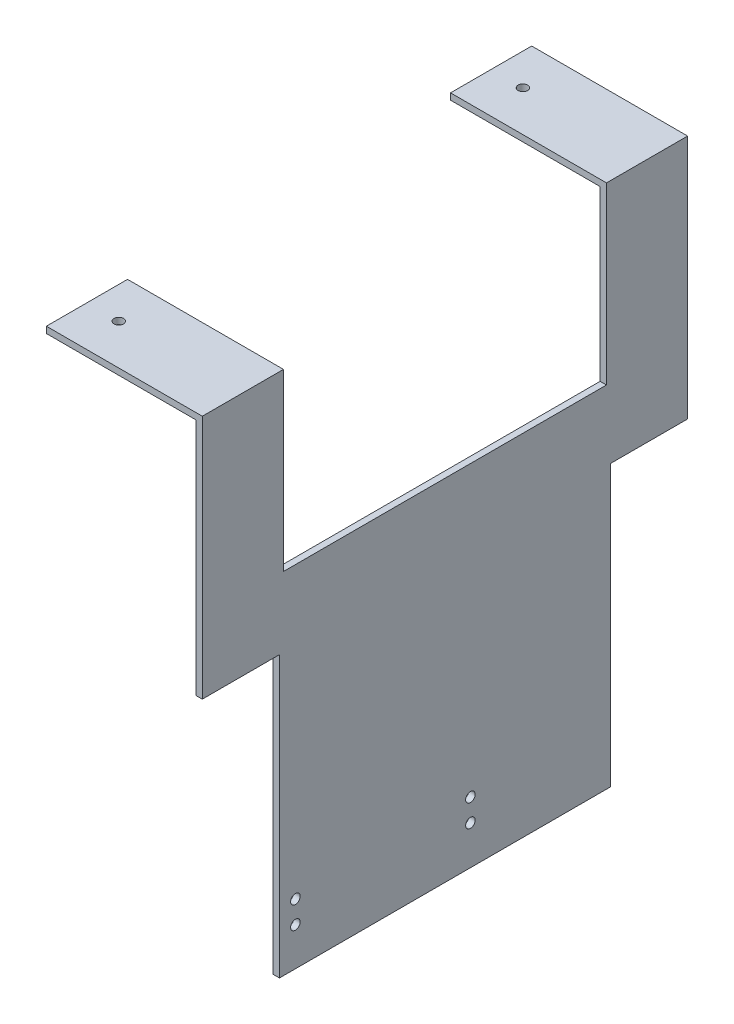
ISO-10303-21;
HEADER;
FILE_DESCRIPTION(('STEP AP214'),'2;1');
FILE_NAME('part.step','',(''),(''),'','','');
FILE_SCHEMA(('AUTOMOTIVE_DESIGN { 1 0 10303 214 1 1 1 1 }'));
ENDSEC;
DATA;
#1=APPLICATION_CONTEXT('core data for automotive mechanical design processes');
#2=APPLICATION_PROTOCOL_DEFINITION('international standard','automotive_design',2000,#1);
#3=PRODUCT_CONTEXT('',#1,'mechanical');
#4=PRODUCT('Part','Part','',(#3));
#5=PRODUCT_RELATED_PRODUCT_CATEGORY('part','',(#4));
#6=PRODUCT_DEFINITION_FORMATION('','',#4);
#7=PRODUCT_DEFINITION_CONTEXT('part definition',#1,'design');
#8=PRODUCT_DEFINITION('design','',#6,#7);
#9=PRODUCT_DEFINITION_SHAPE('','',#8);
#10=(LENGTH_UNIT() NAMED_UNIT(*) SI_UNIT(.MILLI.,.METRE.));
#11=(NAMED_UNIT(*) PLANE_ANGLE_UNIT() SI_UNIT($,.RADIAN.));
#12=(NAMED_UNIT(*) SI_UNIT($,.STERADIAN.) SOLID_ANGLE_UNIT());
#13=UNCERTAINTY_MEASURE_WITH_UNIT(LENGTH_MEASURE(1.E-05),#10,'distance_accuracy_value','');
#14=(GEOMETRIC_REPRESENTATION_CONTEXT(3) GLOBAL_UNCERTAINTY_ASSIGNED_CONTEXT((#13)) GLOBAL_UNIT_ASSIGNED_CONTEXT((#10,
#11,#12)) REPRESENTATION_CONTEXT('',''));
#15=CARTESIAN_POINT('',(0.,0.,0.));
#16=DIRECTION('',(0.,0.,1.));
#17=DIRECTION('',(1.,0.,0.));
#18=AXIS2_PLACEMENT_3D('',#15,#16,#17);
#19=CARTESIAN_POINT('',(488.,-55.,0.));
#20=DIRECTION('',(0.,-1.,0.));
#21=DIRECTION('',(0.,0.,-1.));
#22=AXIS2_PLACEMENT_3D('',#19,#20,#21);
#23=PLANE('',#22);
#24=DIRECTION('',(1.,0.,0.));
#25=VECTOR('',#24,1.);
#26=CARTESIAN_POINT('',(490.,-55.,50.75));
#27=LINE('',#26,#25);
#28=CARTESIAN_POINT('',(488.,-55.,50.75));
#29=VERTEX_POINT('',#28);
#30=CARTESIAN_POINT('',(490.,-55.,50.75));
#31=VERTEX_POINT('',#30);
#32=EDGE_CURVE('E54',#29,#31,#27,.T.);
#33=ORIENTED_EDGE('',*,*,#32,.T.);
#34=DIRECTION('',(0.,0.,-1.));
#35=VECTOR('',#34,1.);
#36=CARTESIAN_POINT('',(490.,-55.,0.));
#37=LINE('',#36,#35);
#38=CARTESIAN_POINT('',(490.,-55.,-50.75));
#39=VERTEX_POINT('',#38);
#40=EDGE_CURVE('E244',#31,#39,#37,.T.);
#41=ORIENTED_EDGE('',*,*,#40,.T.);
#42=DIRECTION('',(-1.,0.,0.));
#43=VECTOR('',#42,1.);
#44=CARTESIAN_POINT('',(490.,-55.,-50.75));
#45=LINE('',#44,#43);
#46=CARTESIAN_POINT('',(488.,-55.,-50.75));
#47=VERTEX_POINT('',#46);
#48=EDGE_CURVE('E273',#39,#47,#45,.T.);
#49=ORIENTED_EDGE('',*,*,#48,.T.);
#50=DIRECTION('',(0.,0.,-1.));
#51=VECTOR('',#50,1.);
#52=CARTESIAN_POINT('',(488.,-55.,0.));
#53=LINE('',#52,#51);
#54=EDGE_CURVE('E49',#29,#47,#53,.T.);
#55=ORIENTED_EDGE('',*,*,#54,.F.);
#56=EDGE_LOOP('',(#33,#41,#49,#55));
#57=FACE_BOUND('',#56,.T.);
#58=ADVANCED_FACE('F34',(#57),#23,.F.);
#59=CARTESIAN_POINT('',(0.,-2.,0.));
#60=DIRECTION('',(0.,-1.,0.));
#61=DIRECTION('',(0.,0.,-1.));
#62=AXIS2_PLACEMENT_3D('',#59,#60,#61);
#63=PLANE('',#62);
#64=DIRECTION('',(0.,0.,-1.));
#65=VECTOR('',#64,1.);
#66=CARTESIAN_POINT('',(488.,-2.,-50.75));
#67=LINE('',#66,#65);
#68=CARTESIAN_POINT('',(488.,-2.,-50.75));
#69=VERTEX_POINT('',#68);
#70=CARTESIAN_POINT('',(488.,-2.,-76.25));
#71=VERTEX_POINT('',#70);
#72=EDGE_CURVE('E262',#69,#71,#67,.T.);
#73=ORIENTED_EDGE('',*,*,#72,.F.);
#74=DIRECTION('',(-1.,0.,0.));
#75=VECTOR('',#74,1.);
#76=CARTESIAN_POINT('',(441.,-2.,-50.75));
#77=LINE('',#76,#75);
#78=CARTESIAN_POINT('',(441.,-2.,-50.75));
#79=VERTEX_POINT('',#78);
#80=EDGE_CURVE('E295',#69,#79,#77,.T.);
#81=ORIENTED_EDGE('',*,*,#80,.T.);
#82=DIRECTION('',(0.,0.,-1.));
#83=VECTOR('',#82,1.);
#84=CARTESIAN_POINT('',(441.,-2.,-50.75));
#85=LINE('',#84,#83);
#86=CARTESIAN_POINT('',(441.,-2.,-76.25));
#87=VERTEX_POINT('',#86);
#88=EDGE_CURVE('E289',#79,#87,#85,.T.);
#89=ORIENTED_EDGE('',*,*,#88,.T.);
#90=DIRECTION('',(1.,0.,0.));
#91=VECTOR('',#90,1.);
#92=CARTESIAN_POINT('',(441.,-2.,-76.25));
#93=LINE('',#92,#91);
#94=EDGE_CURVE('E292',#87,#71,#93,.T.);
#95=ORIENTED_EDGE('',*,*,#94,.T.);
#96=EDGE_LOOP('',(#73,#81,#89,#95));
#97=FACE_BOUND('',#96,.T.);
#98=CARTESIAN_POINT('',(451.,-2.,-63.5));
#99=DIRECTION('',(0.,-1.,0.));
#100=DIRECTION('',(0.,0.,-1.));
#101=AXIS2_PLACEMENT_3D('',#98,#99,#100);
#102=CIRCLE('',#101,1.50000000000002);
#103=CARTESIAN_POINT('',(451.,-2.,-65.));
#104=VERTEX_POINT('',#103);
#105=EDGE_CURVE('E283',#104,#104,#102,.T.);
#106=ORIENTED_EDGE('',*,*,#105,.F.);
#107=EDGE_LOOP('',(#106));
#108=FACE_BOUND('',#107,.T.);
#109=ADVANCED_FACE('F333',(#97,#108),#63,.T.);
#110=CARTESIAN_POINT('',(0.,0.,0.));
#111=DIRECTION('',(0.,-1.,0.));
#112=DIRECTION('',(0.,0.,-1.));
#113=AXIS2_PLACEMENT_3D('',#110,#111,#112);
#114=PLANE('',#113);
#115=DIRECTION('',(0.,0.,-1.));
#116=VECTOR('',#115,1.);
#117=CARTESIAN_POINT('',(441.,0.,-50.75));
#118=LINE('',#117,#116);
#119=CARTESIAN_POINT('',(441.,0.,-50.75));
#120=VERTEX_POINT('',#119);
#121=CARTESIAN_POINT('',(441.,0.,-76.25));
#122=VERTEX_POINT('',#121);
#123=EDGE_CURVE('E286',#120,#122,#118,.T.);
#124=ORIENTED_EDGE('',*,*,#123,.F.);
#125=DIRECTION('',(-1.,0.,0.));
#126=VECTOR('',#125,1.);
#127=CARTESIAN_POINT('',(441.,0.,-50.75));
#128=LINE('',#127,#126);
#129=CARTESIAN_POINT('',(490.,0.,-50.75));
#130=VERTEX_POINT('',#129);
#131=EDGE_CURVE('E293',#130,#120,#128,.T.);
#132=ORIENTED_EDGE('',*,*,#131,.F.);
#133=DIRECTION('',(0.,0.,1.));
#134=VECTOR('',#133,1.);
#135=CARTESIAN_POINT('',(490.,0.,-50.75));
#136=LINE('',#135,#134);
#137=CARTESIAN_POINT('',(490.,0.,-76.25));
#138=VERTEX_POINT('',#137);
#139=EDGE_CURVE('E302',#138,#130,#136,.T.);
#140=ORIENTED_EDGE('',*,*,#139,.F.);
#141=DIRECTION('',(1.,0.,0.));
#142=VECTOR('',#141,1.);
#143=CARTESIAN_POINT('',(441.,0.,-76.25));
#144=LINE('',#143,#142);
#145=EDGE_CURVE('E300',#122,#138,#144,.T.);
#146=ORIENTED_EDGE('',*,*,#145,.F.);
#147=EDGE_LOOP('',(#124,#132,#140,#146));
#148=FACE_BOUND('',#147,.T.);
#149=CARTESIAN_POINT('',(451.,0.,-63.5));
#150=DIRECTION('',(0.,-1.,0.));
#151=DIRECTION('',(0.,0.,-1.));
#152=AXIS2_PLACEMENT_3D('',#149,#150,#151);
#153=CIRCLE('',#152,1.50000000000002);
#154=CARTESIAN_POINT('',(451.,0.,-65.));
#155=VERTEX_POINT('',#154);
#156=EDGE_CURVE('E282',#155,#155,#153,.T.);
#157=ORIENTED_EDGE('',*,*,#156,.T.);
#158=EDGE_LOOP('',(#157));
#159=FACE_BOUND('',#158,.T.);
#160=ADVANCED_FACE('F322',(#148,#159),#114,.F.);
#161=CARTESIAN_POINT('',(441.,-2.,-50.75));
#162=DIRECTION('',(1.,0.,0.));
#163=DIRECTION('',(0.,0.,-1.));
#164=AXIS2_PLACEMENT_3D('',#161,#162,#163);
#165=PLANE('',#164);
#166=ORIENTED_EDGE('',*,*,#123,.T.);
#167=DIRECTION('',(0.,1.,0.));
#168=VECTOR('',#167,1.);
#169=CARTESIAN_POINT('',(441.,-2.,-76.25));
#170=LINE('',#169,#168);
#171=EDGE_CURVE('E11',#87,#122,#170,.T.);
#172=ORIENTED_EDGE('',*,*,#171,.F.);
#173=ORIENTED_EDGE('',*,*,#88,.F.);
#174=DIRECTION('',(0.,1.,0.));
#175=VECTOR('',#174,1.);
#176=CARTESIAN_POINT('',(441.,-2.,-50.75));
#177=LINE('',#176,#175);
#178=EDGE_CURVE('E297',#79,#120,#177,.T.);
#179=ORIENTED_EDGE('',*,*,#178,.T.);
#180=EDGE_LOOP('',(#166,#172,#173,#179));
#181=FACE_BOUND('',#180,.T.);
#182=ADVANCED_FACE('F36',(#181),#165,.F.);
#183=CARTESIAN_POINT('',(441.,-2.,-76.25));
#184=DIRECTION('',(0.,0.,1.));
#185=DIRECTION('',(1.,0.,0.));
#186=AXIS2_PLACEMENT_3D('',#183,#184,#185);
#187=PLANE('',#186);
#188=ORIENTED_EDGE('',*,*,#145,.T.);
#189=DIRECTION('',(0.,1.,0.));
#190=VECTOR('',#189,1.);
#191=CARTESIAN_POINT('',(490.,-2.,-76.25));
#192=LINE('',#191,#190);
#193=CARTESIAN_POINT('',(490.,-77.,-76.25));
#194=VERTEX_POINT('',#193);
#195=EDGE_CURVE('E42',#194,#138,#192,.T.);
#196=ORIENTED_EDGE('',*,*,#195,.F.);
#197=DIRECTION('',(1.,0.,0.));
#198=VECTOR('',#197,1.);
#199=CARTESIAN_POINT('',(488.,-77.,-76.25));
#200=LINE('',#199,#198);
#201=CARTESIAN_POINT('',(488.,-77.,-76.25));
#202=VERTEX_POINT('',#201);
#203=EDGE_CURVE('E263',#202,#194,#200,.T.);
#204=ORIENTED_EDGE('',*,*,#203,.F.);
#205=DIRECTION('',(0.,1.,0.));
#206=VECTOR('',#205,1.);
#207=CARTESIAN_POINT('',(488.,-55.,-76.25));
#208=LINE('',#207,#206);
#209=EDGE_CURVE('E275',#202,#71,#208,.T.);
#210=ORIENTED_EDGE('',*,*,#209,.T.);
#211=ORIENTED_EDGE('',*,*,#94,.F.);
#212=ORIENTED_EDGE('',*,*,#171,.T.);
#213=EDGE_LOOP('',(#188,#196,#204,#210,#211,#212));
#214=FACE_BOUND('',#213,.T.);
#215=ADVANCED_FACE('F337',(#214),#187,.F.);
#216=CARTESIAN_POINT('',(490.,-2.,-50.75));
#217=DIRECTION('',(-1.,0.,0.));
#218=DIRECTION('',(0.,0.,1.));
#219=AXIS2_PLACEMENT_3D('',#216,#217,#218);
#220=PLANE('',#219);
#221=ORIENTED_EDGE('',*,*,#139,.T.);
#222=DIRECTION('',(0.,1.,0.));
#223=VECTOR('',#222,1.);
#224=CARTESIAN_POINT('',(490.,-2.,-50.75));
#225=LINE('',#224,#223);
#226=EDGE_CURVE('E307',#39,#130,#225,.T.);
#227=ORIENTED_EDGE('',*,*,#226,.F.);
#228=ORIENTED_EDGE('',*,*,#40,.F.);
#229=DIRECTION('',(0.,1.,0.));
#230=VECTOR('',#229,1.);
#231=CARTESIAN_POINT('',(490.,-2.,50.75));
#232=LINE('',#231,#230);
#233=CARTESIAN_POINT('',(490.,0.,50.75));
#234=VERTEX_POINT('',#233);
#235=EDGE_CURVE('E194',#31,#234,#232,.T.);
#236=ORIENTED_EDGE('',*,*,#235,.T.);
#237=DIRECTION('',(0.,0.,1.));
#238=VECTOR('',#237,1.);
#239=CARTESIAN_POINT('',(490.,0.,50.75));
#240=LINE('',#239,#238);
#241=CARTESIAN_POINT('',(490.,0.,76.25));
#242=VERTEX_POINT('',#241);
#243=EDGE_CURVE('E188',#234,#242,#240,.T.);
#244=ORIENTED_EDGE('',*,*,#243,.T.);
#245=DIRECTION('',(0.,-1.,0.));
#246=VECTOR('',#245,1.);
#247=CARTESIAN_POINT('',(490.,0.,76.25));
#248=LINE('',#247,#246);
#249=CARTESIAN_POINT('',(490.,-77.,76.25));
#250=VERTEX_POINT('',#249);
#251=EDGE_CURVE('E246',#242,#250,#248,.T.);
#252=ORIENTED_EDGE('',*,*,#251,.T.);
#253=DIRECTION('',(0.,0.,-1.));
#254=VECTOR('',#253,1.);
#255=CARTESIAN_POINT('',(490.,-77.,0.));
#256=LINE('',#255,#254);
#257=CARTESIAN_POINT('',(490.,-77.,52.));
#258=VERTEX_POINT('',#257);
#259=EDGE_CURVE('E199',#250,#258,#256,.T.);
#260=ORIENTED_EDGE('',*,*,#259,.T.);
#261=DIRECTION('',(0.,-1.,0.));
#262=VECTOR('',#261,1.);
#263=CARTESIAN_POINT('',(490.,0.,52.));
#264=LINE('',#263,#262);
#265=CARTESIAN_POINT('',(490.,-165.,52.));
#266=VERTEX_POINT('',#265);
#267=EDGE_CURVE('E232',#258,#266,#264,.T.);
#268=ORIENTED_EDGE('',*,*,#267,.T.);
#269=DIRECTION('',(0.,0.,-1.));
#270=VECTOR('',#269,1.);
#271=CARTESIAN_POINT('',(490.,-165.,0.));
#272=LINE('',#271,#270);
#273=CARTESIAN_POINT('',(490.,-165.,-52.));
#274=VERTEX_POINT('',#273);
#275=EDGE_CURVE('E235',#266,#274,#272,.T.);
#276=ORIENTED_EDGE('',*,*,#275,.T.);
#277=DIRECTION('',(0.,-1.,0.));
#278=VECTOR('',#277,1.);
#279=CARTESIAN_POINT('',(490.,0.,-52.));
#280=LINE('',#279,#278);
#281=CARTESIAN_POINT('',(490.,-77.,-52.));
#282=VERTEX_POINT('',#281);
#283=EDGE_CURVE('E238',#282,#274,#280,.T.);
#284=ORIENTED_EDGE('',*,*,#283,.F.);
#285=DIRECTION('',(0.,0.,-1.));
#286=VECTOR('',#285,1.);
#287=CARTESIAN_POINT('',(490.,-77.,0.));
#288=LINE('',#287,#286);
#289=EDGE_CURVE('E241',#282,#194,#288,.T.);
#290=ORIENTED_EDGE('',*,*,#289,.T.);
#291=ORIENTED_EDGE('',*,*,#195,.T.);
#292=EDGE_LOOP('',(#221,#227,#228,#236,#244,#252,#260,#268,#276,#284,#290,#291));
#293=FACE_BOUND('',#292,.T.);
#294=CARTESIAN_POINT('',(490.,-146.,47.));
#295=DIRECTION('',(1.,0.,0.));
#296=DIRECTION('',(0.,0.,-1.));
#297=AXIS2_PLACEMENT_3D('',#294,#295,#296);
#298=CIRCLE('',#297,1.5);
#299=CARTESIAN_POINT('',(490.,-146.,45.5));
#300=VERTEX_POINT('',#299);
#301=EDGE_CURVE('E249',#300,#300,#298,.T.);
#302=ORIENTED_EDGE('',*,*,#301,.F.);
#303=EDGE_LOOP('',(#302));
#304=FACE_BOUND('',#303,.T.);
#305=CARTESIAN_POINT('',(490.,-153.,47.));
#306=DIRECTION('',(1.,0.,0.));
#307=DIRECTION('',(0.,0.,-1.));
#308=AXIS2_PLACEMENT_3D('',#305,#306,#307);
#309=CIRCLE('',#308,1.5);
#310=CARTESIAN_POINT('',(490.,-153.,45.5));
#311=VERTEX_POINT('',#310);
#312=EDGE_CURVE('E252',#311,#311,#309,.T.);
#313=ORIENTED_EDGE('',*,*,#312,.F.);
#314=EDGE_LOOP('',(#313));
#315=FACE_BOUND('',#314,.T.);
#316=CARTESIAN_POINT('',(490.,-152.771300409595,-7.99999999999999));
#317=DIRECTION('',(1.,0.,0.));
#318=DIRECTION('',(0.,0.,-1.));
#319=AXIS2_PLACEMENT_3D('',#316,#317,#318);
#320=CIRCLE('',#319,1.5);
#321=CARTESIAN_POINT('',(490.,-152.771300409595,-9.5));
#322=VERTEX_POINT('',#321);
#323=EDGE_CURVE('E255',#322,#322,#320,.T.);
#324=ORIENTED_EDGE('',*,*,#323,.F.);
#325=EDGE_LOOP('',(#324));
#326=FACE_BOUND('',#325,.T.);
#327=CARTESIAN_POINT('',(490.,-145.771300425744,-7.99952451162405));
#328=DIRECTION('',(1.,0.,0.));
#329=DIRECTION('',(0.,0.,-1.));
#330=AXIS2_PLACEMENT_3D('',#327,#328,#329);
#331=CIRCLE('',#330,1.5);
#332=CARTESIAN_POINT('',(490.,-145.771300425744,-9.49952451162405));
#333=VERTEX_POINT('',#332);
#334=EDGE_CURVE('E204',#333,#333,#331,.T.);
#335=ORIENTED_EDGE('',*,*,#334,.F.);
#336=EDGE_LOOP('',(#335));
#337=FACE_BOUND('',#336,.T.);
#338=ADVANCED_FACE('F312',(#293,#304,#315,#326,#337),#220,.F.);
#339=CARTESIAN_POINT('',(441.,-2.,-50.75));
#340=DIRECTION('',(0.,0.,-1.));
#341=DIRECTION('',(-1.,0.,0.));
#342=AXIS2_PLACEMENT_3D('',#339,#340,#341);
#343=PLANE('',#342);
#344=ORIENTED_EDGE('',*,*,#131,.T.);
#345=ORIENTED_EDGE('',*,*,#178,.F.);
#346=ORIENTED_EDGE('',*,*,#80,.F.);
#347=DIRECTION('',(0.,1.,0.));
#348=VECTOR('',#347,1.);
#349=CARTESIAN_POINT('',(488.,-55.,-50.75));
#350=LINE('',#349,#348);
#351=EDGE_CURVE('E279',#47,#69,#350,.T.);
#352=ORIENTED_EDGE('',*,*,#351,.F.);
#353=ORIENTED_EDGE('',*,*,#48,.F.);
#354=ORIENTED_EDGE('',*,*,#226,.T.);
#355=EDGE_LOOP('',(#344,#345,#346,#352,#353,#354));
#356=FACE_BOUND('',#355,.T.);
#357=ADVANCED_FACE('F326',(#356),#343,.F.);
#358=CARTESIAN_POINT('',(451.,-2.,-63.5));
#359=DIRECTION('',(0.,1.,0.));
#360=DIRECTION('',(0.,0.,1.));
#361=AXIS2_PLACEMENT_3D('',#358,#359,#360);
#362=CYLINDRICAL_SURFACE('',#361,1.50000000000002);
#363=ORIENTED_EDGE('',*,*,#105,.T.);
#364=EDGE_LOOP('',(#363));
#365=FACE_BOUND('',#364,.T.);
#366=ORIENTED_EDGE('',*,*,#156,.F.);
#367=EDGE_LOOP('',(#366));
#368=FACE_BOUND('',#367,.T.);
#369=ADVANCED_FACE('F403',(#365,#368),#362,.F.);
#370=CARTESIAN_POINT('',(488.,-55.,-50.75));
#371=DIRECTION('',(1.,0.,0.));
#372=DIRECTION('',(0.,0.,-1.));
#373=AXIS2_PLACEMENT_3D('',#370,#371,#372);
#374=PLANE('',#373);
#375=ORIENTED_EDGE('',*,*,#72,.T.);
#376=ORIENTED_EDGE('',*,*,#209,.F.);
#377=DIRECTION('',(0.,0.,-1.));
#378=VECTOR('',#377,1.);
#379=CARTESIAN_POINT('',(488.,-77.,0.));
#380=LINE('',#379,#378);
#381=CARTESIAN_POINT('',(488.,-77.,-52.));
#382=VERTEX_POINT('',#381);
#383=EDGE_CURVE('E212',#382,#202,#380,.T.);
#384=ORIENTED_EDGE('',*,*,#383,.F.);
#385=DIRECTION('',(0.,-1.,0.));
#386=VECTOR('',#385,1.);
#387=CARTESIAN_POINT('',(488.,0.,-52.));
#388=LINE('',#387,#386);
#389=CARTESIAN_POINT('',(488.,-165.,-52.));
#390=VERTEX_POINT('',#389);
#391=EDGE_CURVE('E210',#382,#390,#388,.T.);
#392=ORIENTED_EDGE('',*,*,#391,.T.);
#393=DIRECTION('',(0.,0.,-1.));
#394=VECTOR('',#393,1.);
#395=CARTESIAN_POINT('',(488.,-165.,0.));
#396=LINE('',#395,#394);
#397=CARTESIAN_POINT('',(488.,-165.,52.));
#398=VERTEX_POINT('',#397);
#399=EDGE_CURVE('E207',#398,#390,#396,.T.);
#400=ORIENTED_EDGE('',*,*,#399,.F.);
#401=DIRECTION('',(0.,-1.,0.));
#402=VECTOR('',#401,1.);
#403=CARTESIAN_POINT('',(488.,0.,52.));
#404=LINE('',#403,#402);
#405=CARTESIAN_POINT('',(488.,-77.,52.));
#406=VERTEX_POINT('',#405);
#407=EDGE_CURVE('E203',#406,#398,#404,.T.);
#408=ORIENTED_EDGE('',*,*,#407,.F.);
#409=DIRECTION('',(0.,0.,-1.));
#410=VECTOR('',#409,1.);
#411=CARTESIAN_POINT('',(488.,-77.,0.));
#412=LINE('',#411,#410);
#413=CARTESIAN_POINT('',(488.,-77.,76.25));
#414=VERTEX_POINT('',#413);
#415=EDGE_CURVE('E200',#414,#406,#412,.T.);
#416=ORIENTED_EDGE('',*,*,#415,.F.);
#417=DIRECTION('',(0.,-1.,0.));
#418=VECTOR('',#417,1.);
#419=CARTESIAN_POINT('',(488.,0.,76.25));
#420=LINE('',#419,#418);
#421=CARTESIAN_POINT('',(488.,-2.,76.25));
#422=VERTEX_POINT('',#421);
#423=EDGE_CURVE('E166',#422,#414,#420,.T.);
#424=ORIENTED_EDGE('',*,*,#423,.F.);
#425=DIRECTION('',(0.,0.,-1.));
#426=VECTOR('',#425,1.);
#427=CARTESIAN_POINT('',(488.,-2.,76.25));
#428=LINE('',#427,#426);
#429=CARTESIAN_POINT('',(488.,-2.,50.75));
#430=VERTEX_POINT('',#429);
#431=EDGE_CURVE('E149',#422,#430,#428,.T.);
#432=ORIENTED_EDGE('',*,*,#431,.T.);
#433=DIRECTION('',(0.,1.,0.));
#434=VECTOR('',#433,1.);
#435=CARTESIAN_POINT('',(488.,-55.,50.75));
#436=LINE('',#435,#434);
#437=EDGE_CURVE('E163',#29,#430,#436,.T.);
#438=ORIENTED_EDGE('',*,*,#437,.F.);
#439=ORIENTED_EDGE('',*,*,#54,.T.);
#440=ORIENTED_EDGE('',*,*,#351,.T.);
#441=EDGE_LOOP('',(#375,#376,#384,#392,#400,#408,#416,#424,#432,#438,#439,#440));
#442=FACE_BOUND('',#441,.T.);
#443=CARTESIAN_POINT('',(488.,-146.,47.));
#444=DIRECTION('',(1.,0.,0.));
#445=DIRECTION('',(0.,0.,-1.));
#446=AXIS2_PLACEMENT_3D('',#443,#444,#445);
#447=CIRCLE('',#446,1.5);
#448=CARTESIAN_POINT('',(488.,-146.,45.5));
#449=VERTEX_POINT('',#448);
#450=EDGE_CURVE('E217',#449,#449,#447,.T.);
#451=ORIENTED_EDGE('',*,*,#450,.T.);
#452=EDGE_LOOP('',(#451));
#453=FACE_BOUND('',#452,.T.);
#454=CARTESIAN_POINT('',(488.,-153.,47.));
#455=DIRECTION('',(1.,0.,0.));
#456=DIRECTION('',(0.,0.,-1.));
#457=AXIS2_PLACEMENT_3D('',#454,#455,#456);
#458=CIRCLE('',#457,1.5);
#459=CARTESIAN_POINT('',(488.,-153.,45.5));
#460=VERTEX_POINT('',#459);
#461=EDGE_CURVE('E220',#460,#460,#458,.T.);
#462=ORIENTED_EDGE('',*,*,#461,.T.);
#463=EDGE_LOOP('',(#462));
#464=FACE_BOUND('',#463,.T.);
#465=CARTESIAN_POINT('',(488.,-152.771300409595,-7.99999999999999));
#466=DIRECTION('',(1.,0.,0.));
#467=DIRECTION('',(0.,0.,-1.));
#468=AXIS2_PLACEMENT_3D('',#465,#466,#467);
#469=CIRCLE('',#468,1.5);
#470=CARTESIAN_POINT('',(488.,-152.771300409595,-9.5));
#471=VERTEX_POINT('',#470);
#472=EDGE_CURVE('E223',#471,#471,#469,.T.);
#473=ORIENTED_EDGE('',*,*,#472,.T.);
#474=EDGE_LOOP('',(#473));
#475=FACE_BOUND('',#474,.T.);
#476=CARTESIAN_POINT('',(488.,-145.771300425744,-7.99952451162405));
#477=DIRECTION('',(1.,0.,0.));
#478=DIRECTION('',(0.,0.,-1.));
#479=AXIS2_PLACEMENT_3D('',#476,#477,#478);
#480=CIRCLE('',#479,1.5);
#481=CARTESIAN_POINT('',(488.,-145.771300425744,-9.49952451162405));
#482=VERTEX_POINT('',#481);
#483=EDGE_CURVE('E226',#482,#482,#480,.T.);
#484=ORIENTED_EDGE('',*,*,#483,.T.);
#485=EDGE_LOOP('',(#484));
#486=FACE_BOUND('',#485,.T.);
#487=ADVANCED_FACE('F161',(#442,#453,#464,#475,#486),#374,.F.);
#488=CARTESIAN_POINT('',(488.,-77.,0.));
#489=DIRECTION('',(0.,-1.,0.));
#490=DIRECTION('',(0.,0.,-1.));
#491=AXIS2_PLACEMENT_3D('',#488,#489,#490);
#492=PLANE('',#491);
#493=ORIENTED_EDGE('',*,*,#259,.F.);
#494=DIRECTION('',(1.,0.,0.));
#495=VECTOR('',#494,1.);
#496=CARTESIAN_POINT('',(488.,-77.,76.25));
#497=LINE('',#496,#495);
#498=EDGE_CURVE('E260',#414,#250,#497,.T.);
#499=ORIENTED_EDGE('',*,*,#498,.F.);
#500=ORIENTED_EDGE('',*,*,#415,.T.);
#501=DIRECTION('',(1.,0.,0.));
#502=VECTOR('',#501,1.);
#503=CARTESIAN_POINT('',(488.,-77.,52.));
#504=LINE('',#503,#502);
#505=EDGE_CURVE('E229',#406,#258,#504,.T.);
#506=ORIENTED_EDGE('',*,*,#505,.T.);
#507=EDGE_LOOP('',(#493,#499,#500,#506));
#508=FACE_BOUND('',#507,.T.);
#509=ADVANCED_FACE('F354',(#508),#492,.T.);
#510=CARTESIAN_POINT('',(488.,0.,76.25));
#511=DIRECTION('',(0.,0.,1.));
#512=DIRECTION('',(1.,0.,0.));
#513=AXIS2_PLACEMENT_3D('',#510,#511,#512);
#514=PLANE('',#513);
#515=ORIENTED_EDGE('',*,*,#251,.F.);
#516=DIRECTION('',(-1.,0.,0.));
#517=VECTOR('',#516,1.);
#518=CARTESIAN_POINT('',(441.,0.,76.25));
#519=LINE('',#518,#517);
#520=CARTESIAN_POINT('',(441.,0.,76.25));
#521=VERTEX_POINT('',#520);
#522=EDGE_CURVE('E180',#242,#521,#519,.T.);
#523=ORIENTED_EDGE('',*,*,#522,.T.);
#524=DIRECTION('',(0.,1.,0.));
#525=VECTOR('',#524,1.);
#526=CARTESIAN_POINT('',(441.,-2.,76.25));
#527=LINE('',#526,#525);
#528=CARTESIAN_POINT('',(441.,-2.,76.25));
#529=VERTEX_POINT('',#528);
#530=EDGE_CURVE('E183',#529,#521,#527,.T.);
#531=ORIENTED_EDGE('',*,*,#530,.F.);
#532=DIRECTION('',(-1.,0.,0.));
#533=VECTOR('',#532,1.);
#534=CARTESIAN_POINT('',(441.,-2.,76.25));
#535=LINE('',#534,#533);
#536=EDGE_CURVE('E157',#422,#529,#535,.T.);
#537=ORIENTED_EDGE('',*,*,#536,.F.);
#538=ORIENTED_EDGE('',*,*,#423,.T.);
#539=ORIENTED_EDGE('',*,*,#498,.T.);
#540=EDGE_LOOP('',(#515,#523,#531,#537,#538,#539));
#541=FACE_BOUND('',#540,.T.);
#542=ADVANCED_FACE('F356',(#541),#514,.T.);
#543=CARTESIAN_POINT('',(488.,-77.,0.));
#544=DIRECTION('',(0.,-1.,0.));
#545=DIRECTION('',(0.,0.,-1.));
#546=AXIS2_PLACEMENT_3D('',#543,#544,#545);
#547=PLANE('',#546);
#548=ORIENTED_EDGE('',*,*,#289,.F.);
#549=DIRECTION('',(1.,0.,0.));
#550=VECTOR('',#549,1.);
#551=CARTESIAN_POINT('',(488.,-77.,-52.));
#552=LINE('',#551,#550);
#553=EDGE_CURVE('E266',#382,#282,#552,.T.);
#554=ORIENTED_EDGE('',*,*,#553,.F.);
#555=ORIENTED_EDGE('',*,*,#383,.T.);
#556=ORIENTED_EDGE('',*,*,#203,.T.);
#557=EDGE_LOOP('',(#548,#554,#555,#556));
#558=FACE_BOUND('',#557,.T.);
#559=ADVANCED_FACE('F339',(#558),#547,.T.);
#560=CARTESIAN_POINT('',(488.,0.,-52.));
#561=DIRECTION('',(0.,0.,1.));
#562=DIRECTION('',(0.,-1.,0.));
#563=AXIS2_PLACEMENT_3D('',#560,#561,#562);
#564=PLANE('',#563);
#565=ORIENTED_EDGE('',*,*,#283,.T.);
#566=DIRECTION('',(1.,0.,0.));
#567=VECTOR('',#566,1.);
#568=CARTESIAN_POINT('',(488.,-165.,-52.));
#569=LINE('',#568,#567);
#570=EDGE_CURVE('E268',#390,#274,#569,.T.);
#571=ORIENTED_EDGE('',*,*,#570,.F.);
#572=ORIENTED_EDGE('',*,*,#391,.F.);
#573=ORIENTED_EDGE('',*,*,#553,.T.);
#574=EDGE_LOOP('',(#565,#571,#572,#573));
#575=FACE_BOUND('',#574,.T.);
#576=ADVANCED_FACE('F345',(#575),#564,.F.);
#577=CARTESIAN_POINT('',(488.,-165.,0.));
#578=DIRECTION('',(0.,-1.,0.));
#579=DIRECTION('',(0.,0.,-1.));
#580=AXIS2_PLACEMENT_3D('',#577,#578,#579);
#581=PLANE('',#580);
#582=ORIENTED_EDGE('',*,*,#275,.F.);
#583=DIRECTION('',(1.,0.,0.));
#584=VECTOR('',#583,1.);
#585=CARTESIAN_POINT('',(488.,-165.,52.));
#586=LINE('',#585,#584);
#587=EDGE_CURVE('E270',#398,#266,#586,.T.);
#588=ORIENTED_EDGE('',*,*,#587,.F.);
#589=ORIENTED_EDGE('',*,*,#399,.T.);
#590=ORIENTED_EDGE('',*,*,#570,.T.);
#591=EDGE_LOOP('',(#582,#588,#589,#590));
#592=FACE_BOUND('',#591,.T.);
#593=ADVANCED_FACE('F348',(#592),#581,.T.);
#594=CARTESIAN_POINT('',(488.,-152.771300409595,-7.99999999999999));
#595=DIRECTION('',(1.,0.,0.));
#596=DIRECTION('',(0.,0.,-1.));
#597=AXIS2_PLACEMENT_3D('',#594,#595,#596);
#598=CYLINDRICAL_SURFACE('',#597,1.5);
#599=ORIENTED_EDGE('',*,*,#472,.F.);
#600=EDGE_LOOP('',(#599));
#601=FACE_BOUND('',#600,.T.);
#602=ORIENTED_EDGE('',*,*,#323,.T.);
#603=EDGE_LOOP('',(#602));
#604=FACE_BOUND('',#603,.T.);
#605=ADVANCED_FACE('F394',(#601,#604),#598,.F.);
#606=CARTESIAN_POINT('',(488.,-153.,47.));
#607=DIRECTION('',(1.,0.,0.));
#608=DIRECTION('',(0.,0.,-1.));
#609=AXIS2_PLACEMENT_3D('',#606,#607,#608);
#610=CYLINDRICAL_SURFACE('',#609,1.5);
#611=ORIENTED_EDGE('',*,*,#461,.F.);
#612=EDGE_LOOP('',(#611));
#613=FACE_BOUND('',#612,.T.);
#614=ORIENTED_EDGE('',*,*,#312,.T.);
#615=EDGE_LOOP('',(#614));
#616=FACE_BOUND('',#615,.T.);
#617=ADVANCED_FACE('F507',(#613,#616),#610,.F.);
#618=CARTESIAN_POINT('',(488.,-146.,47.));
#619=DIRECTION('',(1.,0.,0.));
#620=DIRECTION('',(0.,0.,-1.));
#621=AXIS2_PLACEMENT_3D('',#618,#619,#620);
#622=CYLINDRICAL_SURFACE('',#621,1.5);
#623=ORIENTED_EDGE('',*,*,#450,.F.);
#624=EDGE_LOOP('',(#623));
#625=FACE_BOUND('',#624,.T.);
#626=ORIENTED_EDGE('',*,*,#301,.T.);
#627=EDGE_LOOP('',(#626));
#628=FACE_BOUND('',#627,.T.);
#629=ADVANCED_FACE('F398',(#625,#628),#622,.F.);
#630=CARTESIAN_POINT('',(488.,0.,52.));
#631=DIRECTION('',(0.,0.,1.));
#632=DIRECTION('',(0.,-1.,0.));
#633=AXIS2_PLACEMENT_3D('',#630,#631,#632);
#634=PLANE('',#633);
#635=ORIENTED_EDGE('',*,*,#267,.F.);
#636=ORIENTED_EDGE('',*,*,#505,.F.);
#637=ORIENTED_EDGE('',*,*,#407,.T.);
#638=ORIENTED_EDGE('',*,*,#587,.T.);
#639=EDGE_LOOP('',(#635,#636,#637,#638));
#640=FACE_BOUND('',#639,.T.);
#641=ADVANCED_FACE('F351',(#640),#634,.T.);
#642=CARTESIAN_POINT('',(488.,-145.771300425744,-7.99952451162405));
#643=DIRECTION('',(1.,0.,0.));
#644=DIRECTION('',(0.,0.,-1.));
#645=AXIS2_PLACEMENT_3D('',#642,#643,#644);
#646=CYLINDRICAL_SURFACE('',#645,1.5);
#647=ORIENTED_EDGE('',*,*,#483,.F.);
#648=EDGE_LOOP('',(#647));
#649=FACE_BOUND('',#648,.T.);
#650=ORIENTED_EDGE('',*,*,#334,.T.);
#651=EDGE_LOOP('',(#650));
#652=FACE_BOUND('',#651,.T.);
#653=ADVANCED_FACE('F397',(#649,#652),#646,.F.);
#654=CARTESIAN_POINT('',(0.,-2.,0.));
#655=DIRECTION('',(0.,1.,0.));
#656=DIRECTION('',(0.,0.,1.));
#657=AXIS2_PLACEMENT_3D('',#654,#655,#656);
#658=PLANE('',#657);
#659=CARTESIAN_POINT('',(451.,-2.,63.5));
#660=DIRECTION('',(0.,-1.,0.));
#661=DIRECTION('',(0.,0.,-1.));
#662=AXIS2_PLACEMENT_3D('',#659,#660,#661);
#663=CIRCLE('',#662,1.50000000000002);
#664=CARTESIAN_POINT('',(451.,-2.,62.));
#665=VERTEX_POINT('',#664);
#666=EDGE_CURVE('E173',#665,#665,#663,.T.);
#667=ORIENTED_EDGE('',*,*,#666,.F.);
#668=EDGE_LOOP('',(#667));
#669=FACE_BOUND('',#668,.T.);
#670=ORIENTED_EDGE('',*,*,#431,.F.);
#671=ORIENTED_EDGE('',*,*,#536,.T.);
#672=DIRECTION('',(0.,0.,-1.));
#673=VECTOR('',#672,1.);
#674=CARTESIAN_POINT('',(441.,-2.,50.75));
#675=LINE('',#674,#673);
#676=CARTESIAN_POINT('',(441.,-2.,50.75));
#677=VERTEX_POINT('',#676);
#678=EDGE_CURVE('E152',#529,#677,#675,.T.);
#679=ORIENTED_EDGE('',*,*,#678,.T.);
#680=DIRECTION('',(1.,0.,0.));
#681=VECTOR('',#680,1.);
#682=CARTESIAN_POINT('',(441.,-2.,50.75));
#683=LINE('',#682,#681);
#684=EDGE_CURVE('E146',#677,#430,#683,.T.);
#685=ORIENTED_EDGE('',*,*,#684,.T.);
#686=EDGE_LOOP('',(#670,#671,#679,#685));
#687=FACE_BOUND('',#686,.T.);
#688=ADVANCED_FACE('F148',(#669,#687),#658,.F.);
#689=CARTESIAN_POINT('',(0.,0.,0.));
#690=DIRECTION('',(0.,1.,0.));
#691=DIRECTION('',(0.,0.,1.));
#692=AXIS2_PLACEMENT_3D('',#689,#690,#691);
#693=PLANE('',#692);
#694=DIRECTION('',(0.,0.,-1.));
#695=VECTOR('',#694,1.);
#696=CARTESIAN_POINT('',(441.,0.,50.75));
#697=LINE('',#696,#695);
#698=CARTESIAN_POINT('',(441.,0.,50.75));
#699=VERTEX_POINT('',#698);
#700=EDGE_CURVE('E178',#521,#699,#697,.T.);
#701=ORIENTED_EDGE('',*,*,#700,.F.);
#702=ORIENTED_EDGE('',*,*,#522,.F.);
#703=ORIENTED_EDGE('',*,*,#243,.F.);
#704=DIRECTION('',(1.,0.,0.));
#705=VECTOR('',#704,1.);
#706=CARTESIAN_POINT('',(441.,0.,50.75));
#707=LINE('',#706,#705);
#708=EDGE_CURVE('E186',#699,#234,#707,.T.);
#709=ORIENTED_EDGE('',*,*,#708,.F.);
#710=EDGE_LOOP('',(#701,#702,#703,#709));
#711=FACE_BOUND('',#710,.T.);
#712=CARTESIAN_POINT('',(451.,0.,63.5));
#713=DIRECTION('',(0.,-1.,0.));
#714=DIRECTION('',(0.,0.,-1.));
#715=AXIS2_PLACEMENT_3D('',#712,#713,#714);
#716=CIRCLE('',#715,1.50000000000002);
#717=CARTESIAN_POINT('',(451.,0.,62.));
#718=VERTEX_POINT('',#717);
#719=EDGE_CURVE('E170',#718,#718,#716,.T.);
#720=ORIENTED_EDGE('',*,*,#719,.T.);
#721=EDGE_LOOP('',(#720));
#722=FACE_BOUND('',#721,.T.);
#723=ADVANCED_FACE('F364',(#711,#722),#693,.T.);
#724=CARTESIAN_POINT('',(441.,-2.,50.75));
#725=DIRECTION('',(1.,0.,0.));
#726=DIRECTION('',(0.,0.,-1.));
#727=AXIS2_PLACEMENT_3D('',#724,#725,#726);
#728=PLANE('',#727);
#729=ORIENTED_EDGE('',*,*,#700,.T.);
#730=DIRECTION('',(0.,1.,0.));
#731=VECTOR('',#730,1.);
#732=CARTESIAN_POINT('',(441.,-2.,50.75));
#733=LINE('',#732,#731);
#734=EDGE_CURVE('E197',#677,#699,#733,.T.);
#735=ORIENTED_EDGE('',*,*,#734,.F.);
#736=ORIENTED_EDGE('',*,*,#678,.F.);
#737=ORIENTED_EDGE('',*,*,#530,.T.);
#738=EDGE_LOOP('',(#729,#735,#736,#737));
#739=FACE_BOUND('',#738,.T.);
#740=ADVANCED_FACE('F361',(#739),#728,.F.);
#741=CARTESIAN_POINT('',(441.,-2.,50.75));
#742=DIRECTION('',(0.,0.,1.));
#743=DIRECTION('',(1.,0.,0.));
#744=AXIS2_PLACEMENT_3D('',#741,#742,#743);
#745=PLANE('',#744);
#746=ORIENTED_EDGE('',*,*,#708,.T.);
#747=ORIENTED_EDGE('',*,*,#235,.F.);
#748=ORIENTED_EDGE('',*,*,#32,.F.);
#749=ORIENTED_EDGE('',*,*,#437,.T.);
#750=ORIENTED_EDGE('',*,*,#684,.F.);
#751=ORIENTED_EDGE('',*,*,#734,.T.);
#752=EDGE_LOOP('',(#746,#747,#748,#749,#750,#751));
#753=FACE_BOUND('',#752,.T.);
#754=ADVANCED_FACE('F168',(#753),#745,.F.);
#755=CARTESIAN_POINT('',(451.,-2.,63.5));
#756=DIRECTION('',(0.,1.,0.));
#757=DIRECTION('',(0.,0.,1.));
#758=AXIS2_PLACEMENT_3D('',#755,#756,#757);
#759=CYLINDRICAL_SURFACE('',#758,1.50000000000002);
#760=ORIENTED_EDGE('',*,*,#666,.T.);
#761=EDGE_LOOP('',(#760));
#762=FACE_BOUND('',#761,.T.);
#763=ORIENTED_EDGE('',*,*,#719,.F.);
#764=EDGE_LOOP('',(#763));
#765=FACE_BOUND('',#764,.T.);
#766=ADVANCED_FACE('F370',(#762,#765),#759,.F.);
#767=CLOSED_SHELL('',(#58,#109,#160,#182,#215,#338,#357,#369,#487,#509,#542,#559,#576,#593,#605,
#617,#629,#641,#653,#688,#723,#740,#754,#766));
#768=MANIFOLD_SOLID_BREP('B2',#767);
#769=ADVANCED_BREP_SHAPE_REPRESENTATION('',(#18,#768),#14);
#770=SHAPE_DEFINITION_REPRESENTATION(#9,#769);
ENDSEC;
END-ISO-10303-21;
